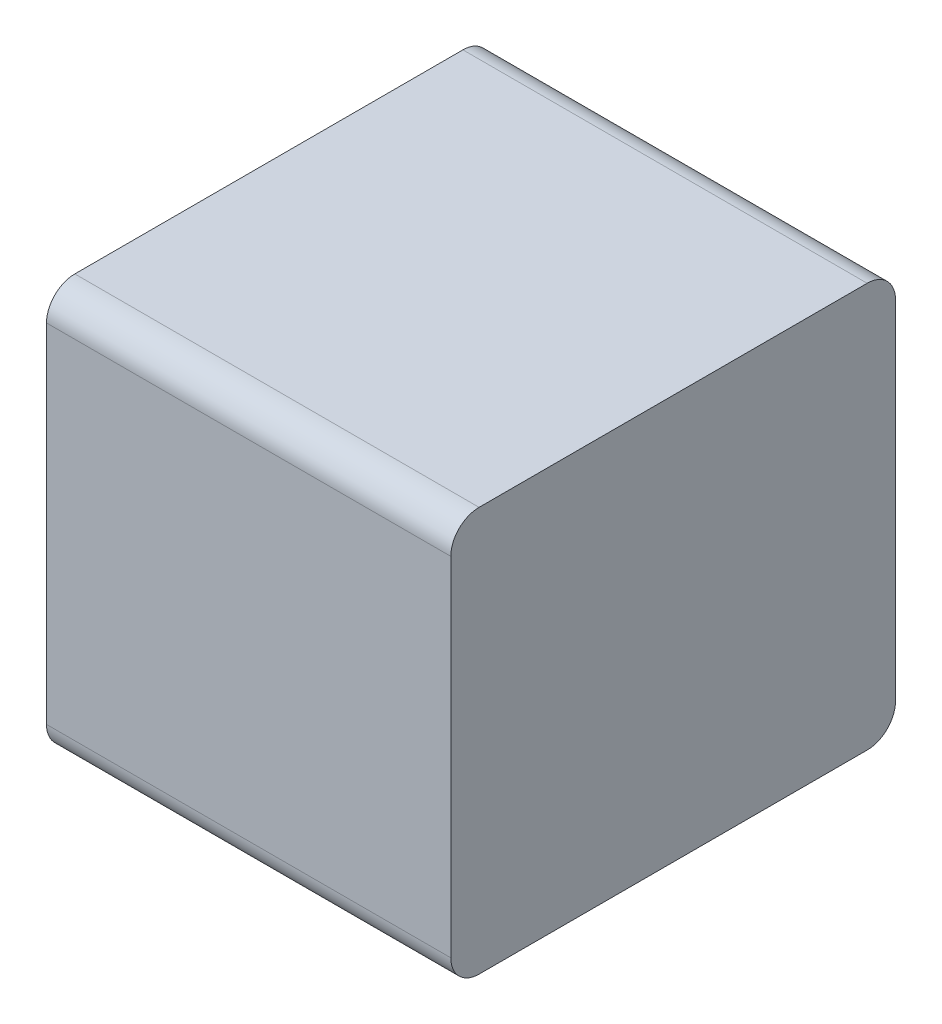
ISO-10303-21;
HEADER;
FILE_DESCRIPTION(('STEP AP214'),'2;1');
FILE_NAME('part.step','',(''),(''),'','','');
FILE_SCHEMA(('AUTOMOTIVE_DESIGN { 1 0 10303 214 1 1 1 1 }'));
ENDSEC;
DATA;
#1=APPLICATION_CONTEXT('core data for automotive mechanical design processes');
#2=APPLICATION_PROTOCOL_DEFINITION('international standard','automotive_design',2000,#1);
#3=PRODUCT_CONTEXT('',#1,'mechanical');
#4=PRODUCT('Part','Part','',(#3));
#5=PRODUCT_RELATED_PRODUCT_CATEGORY('part','',(#4));
#6=PRODUCT_DEFINITION_FORMATION('','',#4);
#7=PRODUCT_DEFINITION_CONTEXT('part definition',#1,'design');
#8=PRODUCT_DEFINITION('design','',#6,#7);
#9=PRODUCT_DEFINITION_SHAPE('','',#8);
#10=(LENGTH_UNIT() NAMED_UNIT(*) SI_UNIT(.MILLI.,.METRE.));
#11=(NAMED_UNIT(*) PLANE_ANGLE_UNIT() SI_UNIT($,.RADIAN.));
#12=(NAMED_UNIT(*) SI_UNIT($,.STERADIAN.) SOLID_ANGLE_UNIT());
#13=UNCERTAINTY_MEASURE_WITH_UNIT(LENGTH_MEASURE(1.E-05),#10,'distance_accuracy_value','');
#14=(GEOMETRIC_REPRESENTATION_CONTEXT(3) GLOBAL_UNCERTAINTY_ASSIGNED_CONTEXT((#13)) GLOBAL_UNIT_ASSIGNED_CONTEXT((#10,
#11,#12)) REPRESENTATION_CONTEXT('',''));
#15=CARTESIAN_POINT('',(0.,0.,0.));
#16=DIRECTION('',(0.,0.,1.));
#17=DIRECTION('',(1.,0.,0.));
#18=AXIS2_PLACEMENT_3D('',#15,#16,#17);
#19=CARTESIAN_POINT('',(0.25,0.,0.275));
#20=DIRECTION('',(1.,0.,0.));
#21=DIRECTION('',(0.,0.,-1.));
#22=AXIS2_PLACEMENT_3D('',#19,#20,#21);
#23=PLANE('',#22);
#24=DIRECTION('',(0.,-1.,0.));
#25=VECTOR('',#24,1.);
#26=CARTESIAN_POINT('',(0.25,0.215,0.55));
#27=LINE('',#26,#25);
#28=CARTESIAN_POINT('',(0.25,0.215,0.55));
#29=VERTEX_POINT('',#28);
#30=CARTESIAN_POINT('',(0.25,-0.214999999999999,0.549999999999999));
#31=VERTEX_POINT('',#30);
#32=EDGE_CURVE('E11',#29,#31,#27,.T.);
#33=ORIENTED_EDGE('',*,*,#32,.T.);
#34=CARTESIAN_POINT('',(0.25,-0.214999999999999,0.514999999999999));
#35=DIRECTION('',(1.,0.,0.));
#36=DIRECTION('',(0.,0.,1.));
#37=AXIS2_PLACEMENT_3D('',#34,#35,#36);
#38=CIRCLE('',#37,0.035);
#39=CARTESIAN_POINT('',(0.25,-0.249999999999999,0.514999999999999));
#40=VERTEX_POINT('',#39);
#41=EDGE_CURVE('E24',#31,#40,#38,.T.);
#42=ORIENTED_EDGE('',*,*,#41,.T.);
#43=DIRECTION('',(0.,0.,-1.));
#44=VECTOR('',#43,1.);
#45=CARTESIAN_POINT('',(0.25,-0.249999999999999,0.514999999999999));
#46=LINE('',#45,#44);
#47=CARTESIAN_POINT('',(0.25,-0.249999999999999,0.0349999999999996));
#48=VERTEX_POINT('',#47);
#49=EDGE_CURVE('E141',#40,#48,#46,.T.);
#50=ORIENTED_EDGE('',*,*,#49,.T.);
#51=CARTESIAN_POINT('',(0.25,-0.215,0.0349999999999997));
#52=DIRECTION('',(1.,0.,0.));
#53=DIRECTION('',(0.,-1.,0.));
#54=AXIS2_PLACEMENT_3D('',#51,#52,#53);
#55=CIRCLE('',#54,0.0349999999999999);
#56=CARTESIAN_POINT('',(0.25,-0.215,0.));
#57=VERTEX_POINT('',#56);
#58=EDGE_CURVE('E139',#48,#57,#55,.T.);
#59=ORIENTED_EDGE('',*,*,#58,.T.);
#60=DIRECTION('',(0.,1.,0.));
#61=VECTOR('',#60,1.);
#62=CARTESIAN_POINT('',(0.25,-0.215,0.));
#63=LINE('',#62,#61);
#64=CARTESIAN_POINT('',(0.25,0.215,0.));
#65=VERTEX_POINT('',#64);
#66=EDGE_CURVE('E137',#57,#65,#63,.T.);
#67=ORIENTED_EDGE('',*,*,#66,.T.);
#68=CARTESIAN_POINT('',(0.25,0.215,0.035));
#69=DIRECTION('',(1.,0.,0.));
#70=DIRECTION('',(0.,0.,-1.));
#71=AXIS2_PLACEMENT_3D('',#68,#69,#70);
#72=CIRCLE('',#71,0.035);
#73=CARTESIAN_POINT('',(0.25,0.25,0.035));
#74=VERTEX_POINT('',#73);
#75=EDGE_CURVE('E135',#65,#74,#72,.T.);
#76=ORIENTED_EDGE('',*,*,#75,.T.);
#77=DIRECTION('',(0.,0.,1.));
#78=VECTOR('',#77,1.);
#79=CARTESIAN_POINT('',(0.25,0.25,0.035));
#80=LINE('',#79,#78);
#81=CARTESIAN_POINT('',(0.25,0.25,0.515));
#82=VERTEX_POINT('',#81);
#83=EDGE_CURVE('E133',#74,#82,#80,.T.);
#84=ORIENTED_EDGE('',*,*,#83,.T.);
#85=CARTESIAN_POINT('',(0.25,0.215,0.515));
#86=DIRECTION('',(1.,0.,0.));
#87=DIRECTION('',(0.,1.,0.));
#88=AXIS2_PLACEMENT_3D('',#85,#86,#87);
#89=CIRCLE('',#88,0.0349999999999999);
#90=EDGE_CURVE('E131',#82,#29,#89,.T.);
#91=ORIENTED_EDGE('',*,*,#90,.T.);
#92=EDGE_LOOP('',(#33,#42,#50,#59,#67,#76,#84,#91));
#93=FACE_BOUND('',#92,.T.);
#94=ADVANCED_FACE('F17',(#93),#23,.T.);
#95=CARTESIAN_POINT('',(0.,-0.214999999999999,0.514999999999999));
#96=DIRECTION('',(-1.,0.,0.));
#97=DIRECTION('',(0.,0.,1.));
#98=AXIS2_PLACEMENT_3D('',#95,#96,#97);
#99=CYLINDRICAL_SURFACE('',#98,0.035);
#100=DIRECTION('',(1.,0.,0.));
#101=VECTOR('',#100,1.);
#102=CARTESIAN_POINT('',(0.,-0.214999999999999,0.549999999999999));
#103=LINE('',#102,#101);
#104=CARTESIAN_POINT('',(-0.25,-0.214999999999999,0.549999999999999));
#105=VERTEX_POINT('',#104);
#106=EDGE_CURVE('E129',#105,#31,#103,.T.);
#107=ORIENTED_EDGE('',*,*,#106,.F.);
#108=CARTESIAN_POINT('',(-0.25,-0.214999999999999,0.514999999999999));
#109=DIRECTION('',(-1.,0.,0.));
#110=DIRECTION('',(0.,0.,1.));
#111=AXIS2_PLACEMENT_3D('',#108,#109,#110);
#112=CIRCLE('',#111,0.035);
#113=CARTESIAN_POINT('',(-0.25,-0.249999999999999,0.514999999999999));
#114=VERTEX_POINT('',#113);
#115=EDGE_CURVE('E96',#114,#105,#112,.T.);
#116=ORIENTED_EDGE('',*,*,#115,.F.);
#117=DIRECTION('',(1.,0.,0.));
#118=VECTOR('',#117,1.);
#119=CARTESIAN_POINT('',(0.,-0.249999999999999,0.514999999999999));
#120=LINE('',#119,#118);
#121=EDGE_CURVE('E125',#114,#40,#120,.T.);
#122=ORIENTED_EDGE('',*,*,#121,.T.);
#123=ORIENTED_EDGE('',*,*,#41,.F.);
#124=EDGE_LOOP('',(#107,#116,#122,#123));
#125=FACE_BOUND('',#124,.T.);
#126=ADVANCED_FACE('F149',(#125),#99,.T.);
#127=CARTESIAN_POINT('',(0.,-0.249999999999999,0.0349999999999996));
#128=DIRECTION('',(0.,-1.,0.));
#129=DIRECTION('',(0.,0.,1.));
#130=AXIS2_PLACEMENT_3D('',#127,#128,#129);
#131=PLANE('',#130);
#132=ORIENTED_EDGE('',*,*,#121,.F.);
#133=DIRECTION('',(0.,0.,1.));
#134=VECTOR('',#133,1.);
#135=CARTESIAN_POINT('',(-0.25,-0.249999999999999,0.514999999999999));
#136=LINE('',#135,#134);
#137=CARTESIAN_POINT('',(-0.25,-0.249999999999999,0.0349999999999996));
#138=VERTEX_POINT('',#137);
#139=EDGE_CURVE('E123',#138,#114,#136,.T.);
#140=ORIENTED_EDGE('',*,*,#139,.F.);
#141=DIRECTION('',(1.,0.,0.));
#142=VECTOR('',#141,1.);
#143=CARTESIAN_POINT('',(0.,-0.249999999999999,0.0349999999999996));
#144=LINE('',#143,#142);
#145=EDGE_CURVE('E120',#138,#48,#144,.T.);
#146=ORIENTED_EDGE('',*,*,#145,.T.);
#147=ORIENTED_EDGE('',*,*,#49,.F.);
#148=EDGE_LOOP('',(#132,#140,#146,#147));
#149=FACE_BOUND('',#148,.T.);
#150=ADVANCED_FACE('F147',(#149),#131,.T.);
#151=CARTESIAN_POINT('',(0.,-0.215,0.0349999999999997));
#152=DIRECTION('',(-1.,0.,0.));
#153=DIRECTION('',(0.,-1.,0.));
#154=AXIS2_PLACEMENT_3D('',#151,#152,#153);
#155=CYLINDRICAL_SURFACE('',#154,0.0349999999999999);
#156=ORIENTED_EDGE('',*,*,#145,.F.);
#157=CARTESIAN_POINT('',(-0.25,-0.215,0.0349999999999997));
#158=DIRECTION('',(-1.,0.,0.));
#159=DIRECTION('',(0.,-1.,0.));
#160=AXIS2_PLACEMENT_3D('',#157,#158,#159);
#161=CIRCLE('',#160,0.0349999999999999);
#162=CARTESIAN_POINT('',(-0.25,-0.215,0.));
#163=VERTEX_POINT('',#162);
#164=EDGE_CURVE('E117',#163,#138,#161,.T.);
#165=ORIENTED_EDGE('',*,*,#164,.F.);
#166=DIRECTION('',(1.,0.,0.));
#167=VECTOR('',#166,1.);
#168=CARTESIAN_POINT('',(0.,-0.215,0.));
#169=LINE('',#168,#167);
#170=EDGE_CURVE('E114',#163,#57,#169,.T.);
#171=ORIENTED_EDGE('',*,*,#170,.T.);
#172=ORIENTED_EDGE('',*,*,#58,.F.);
#173=EDGE_LOOP('',(#156,#165,#171,#172));
#174=FACE_BOUND('',#173,.T.);
#175=ADVANCED_FACE('F156',(#174),#155,.T.);
#176=CARTESIAN_POINT('',(0.,0.215,0.));
#177=DIRECTION('',(0.,0.,-1.));
#178=DIRECTION('',(0.,-1.,0.));
#179=AXIS2_PLACEMENT_3D('',#176,#177,#178);
#180=PLANE('',#179);
#181=ORIENTED_EDGE('',*,*,#170,.F.);
#182=DIRECTION('',(0.,-1.,0.));
#183=VECTOR('',#182,1.);
#184=CARTESIAN_POINT('',(-0.25,-0.215,0.));
#185=LINE('',#184,#183);
#186=CARTESIAN_POINT('',(-0.25,0.215,0.));
#187=VERTEX_POINT('',#186);
#188=EDGE_CURVE('E111',#187,#163,#185,.T.);
#189=ORIENTED_EDGE('',*,*,#188,.F.);
#190=DIRECTION('',(1.,0.,0.));
#191=VECTOR('',#190,1.);
#192=CARTESIAN_POINT('',(0.,0.215,0.));
#193=LINE('',#192,#191);
#194=EDGE_CURVE('E108',#187,#65,#193,.T.);
#195=ORIENTED_EDGE('',*,*,#194,.T.);
#196=ORIENTED_EDGE('',*,*,#66,.F.);
#197=EDGE_LOOP('',(#181,#189,#195,#196));
#198=FACE_BOUND('',#197,.T.);
#199=ADVANCED_FACE('F161',(#198),#180,.T.);
#200=CARTESIAN_POINT('',(0.,0.215,0.035));
#201=DIRECTION('',(-1.,0.,0.));
#202=DIRECTION('',(0.,0.,-1.));
#203=AXIS2_PLACEMENT_3D('',#200,#201,#202);
#204=CYLINDRICAL_SURFACE('',#203,0.035);
#205=ORIENTED_EDGE('',*,*,#194,.F.);
#206=CARTESIAN_POINT('',(-0.25,0.215,0.035));
#207=DIRECTION('',(-1.,0.,0.));
#208=DIRECTION('',(0.,0.,-1.));
#209=AXIS2_PLACEMENT_3D('',#206,#207,#208);
#210=CIRCLE('',#209,0.035);
#211=CARTESIAN_POINT('',(-0.25,0.25,0.035));
#212=VERTEX_POINT('',#211);
#213=EDGE_CURVE('E105',#212,#187,#210,.T.);
#214=ORIENTED_EDGE('',*,*,#213,.F.);
#215=DIRECTION('',(1.,0.,0.));
#216=VECTOR('',#215,1.);
#217=CARTESIAN_POINT('',(0.,0.25,0.035));
#218=LINE('',#217,#216);
#219=EDGE_CURVE('E102',#212,#74,#218,.T.);
#220=ORIENTED_EDGE('',*,*,#219,.T.);
#221=ORIENTED_EDGE('',*,*,#75,.F.);
#222=EDGE_LOOP('',(#205,#214,#220,#221));
#223=FACE_BOUND('',#222,.T.);
#224=ADVANCED_FACE('F165',(#223),#204,.T.);
#225=CARTESIAN_POINT('',(0.,0.25,0.515));
#226=DIRECTION('',(0.,1.,0.));
#227=DIRECTION('',(0.,0.,-1.));
#228=AXIS2_PLACEMENT_3D('',#225,#226,#227);
#229=PLANE('',#228);
#230=ORIENTED_EDGE('',*,*,#219,.F.);
#231=DIRECTION('',(0.,0.,-1.));
#232=VECTOR('',#231,1.);
#233=CARTESIAN_POINT('',(-0.25,0.25,0.035));
#234=LINE('',#233,#232);
#235=CARTESIAN_POINT('',(-0.25,0.25,0.515));
#236=VERTEX_POINT('',#235);
#237=EDGE_CURVE('E100',#236,#212,#234,.T.);
#238=ORIENTED_EDGE('',*,*,#237,.F.);
#239=DIRECTION('',(1.,0.,0.));
#240=VECTOR('',#239,1.);
#241=CARTESIAN_POINT('',(0.,0.25,0.515));
#242=LINE('',#241,#240);
#243=EDGE_CURVE('E84',#236,#82,#242,.T.);
#244=ORIENTED_EDGE('',*,*,#243,.T.);
#245=ORIENTED_EDGE('',*,*,#83,.F.);
#246=EDGE_LOOP('',(#230,#238,#244,#245));
#247=FACE_BOUND('',#246,.T.);
#248=ADVANCED_FACE('F169',(#247),#229,.T.);
#249=CARTESIAN_POINT('',(0.,0.215,0.515));
#250=DIRECTION('',(-1.,0.,0.));
#251=DIRECTION('',(0.,1.,0.));
#252=AXIS2_PLACEMENT_3D('',#249,#250,#251);
#253=CYLINDRICAL_SURFACE('',#252,0.0349999999999999);
#254=ORIENTED_EDGE('',*,*,#243,.F.);
#255=CARTESIAN_POINT('',(-0.25,0.215,0.515));
#256=DIRECTION('',(-1.,0.,0.));
#257=DIRECTION('',(0.,1.,0.));
#258=AXIS2_PLACEMENT_3D('',#255,#256,#257);
#259=CIRCLE('',#258,0.0349999999999999);
#260=CARTESIAN_POINT('',(-0.25,0.215,0.55));
#261=VERTEX_POINT('',#260);
#262=EDGE_CURVE('E79',#261,#236,#259,.T.);
#263=ORIENTED_EDGE('',*,*,#262,.F.);
#264=DIRECTION('',(-1.,0.,0.));
#265=VECTOR('',#264,1.);
#266=CARTESIAN_POINT('',(0.,0.215,0.55));
#267=LINE('',#266,#265);
#268=EDGE_CURVE('E82',#29,#261,#267,.T.);
#269=ORIENTED_EDGE('',*,*,#268,.F.);
#270=ORIENTED_EDGE('',*,*,#90,.F.);
#271=EDGE_LOOP('',(#254,#263,#269,#270));
#272=FACE_BOUND('',#271,.T.);
#273=ADVANCED_FACE('F80',(#272),#253,.T.);
#274=CARTESIAN_POINT('',(0.,-0.214999999999999,0.549999999999999));
#275=DIRECTION('',(0.,0.,1.));
#276=DIRECTION('',(0.,1.,0.));
#277=AXIS2_PLACEMENT_3D('',#274,#275,#276);
#278=PLANE('',#277);
#279=ORIENTED_EDGE('',*,*,#268,.T.);
#280=DIRECTION('',(0.,1.,0.));
#281=VECTOR('',#280,1.);
#282=CARTESIAN_POINT('',(-0.25,0.215,0.55));
#283=LINE('',#282,#281);
#284=EDGE_CURVE('E91',#105,#261,#283,.T.);
#285=ORIENTED_EDGE('',*,*,#284,.F.);
#286=ORIENTED_EDGE('',*,*,#106,.T.);
#287=ORIENTED_EDGE('',*,*,#32,.F.);
#288=EDGE_LOOP('',(#279,#285,#286,#287));
#289=FACE_BOUND('',#288,.T.);
#290=ADVANCED_FACE('F90',(#289),#278,.T.);
#291=CARTESIAN_POINT('',(-0.25,0.,0.275));
#292=DIRECTION('',(1.,0.,0.));
#293=DIRECTION('',(0.,0.,-1.));
#294=AXIS2_PLACEMENT_3D('',#291,#292,#293);
#295=PLANE('',#294);
#296=ORIENTED_EDGE('',*,*,#284,.T.);
#297=ORIENTED_EDGE('',*,*,#262,.T.);
#298=ORIENTED_EDGE('',*,*,#237,.T.);
#299=ORIENTED_EDGE('',*,*,#213,.T.);
#300=ORIENTED_EDGE('',*,*,#188,.T.);
#301=ORIENTED_EDGE('',*,*,#164,.T.);
#302=ORIENTED_EDGE('',*,*,#139,.T.);
#303=ORIENTED_EDGE('',*,*,#115,.T.);
#304=EDGE_LOOP('',(#296,#297,#298,#299,#300,#301,#302,#303));
#305=FACE_BOUND('',#304,.T.);
#306=ADVANCED_FACE('F94',(#305),#295,.F.);
#307=CLOSED_SHELL('',(#94,#126,#150,#175,#199,#224,#248,#273,#290,#306));
#308=MANIFOLD_SOLID_BREP('B1',#307);
#309=ADVANCED_BREP_SHAPE_REPRESENTATION('',(#18,#308),#14);
#310=SHAPE_DEFINITION_REPRESENTATION(#9,#309);
ENDSEC;
END-ISO-10303-21;
